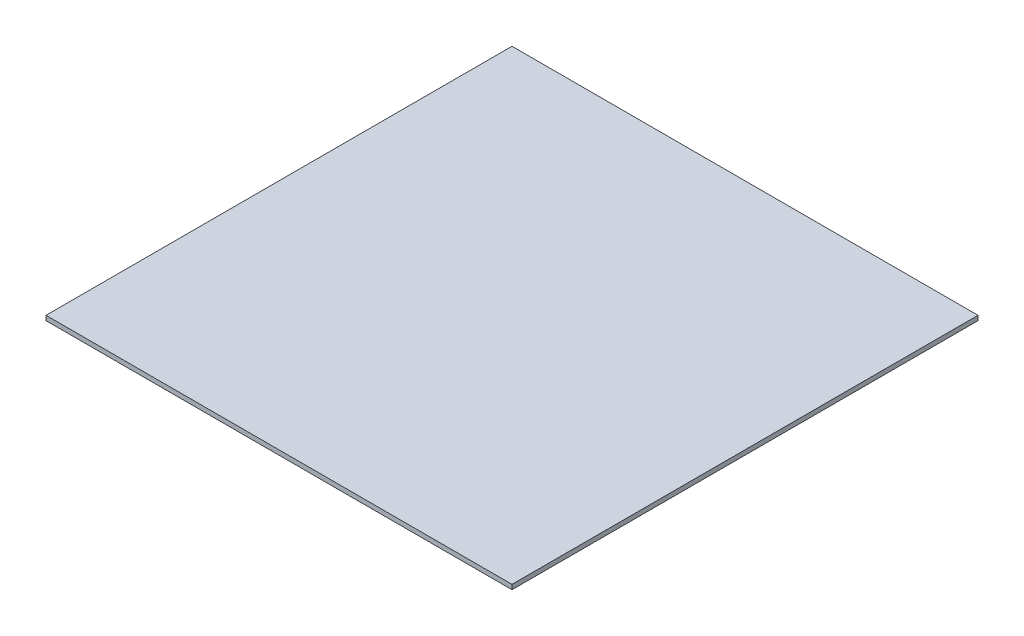
ISO-10303-21;
HEADER;
FILE_DESCRIPTION(('STEP AP214'),'2;1');
FILE_NAME('part.step','',(''),(''),'','','');
FILE_SCHEMA(('AUTOMOTIVE_DESIGN { 1 0 10303 214 1 1 1 1 }'));
ENDSEC;
DATA;
#1=APPLICATION_CONTEXT('core data for automotive mechanical design processes');
#2=APPLICATION_PROTOCOL_DEFINITION('international standard','automotive_design',2000,#1);
#3=PRODUCT_CONTEXT('',#1,'mechanical');
#4=PRODUCT('Part','Part','',(#3));
#5=PRODUCT_RELATED_PRODUCT_CATEGORY('part','',(#4));
#6=PRODUCT_DEFINITION_FORMATION('','',#4);
#7=PRODUCT_DEFINITION_CONTEXT('part definition',#1,'design');
#8=PRODUCT_DEFINITION('design','',#6,#7);
#9=PRODUCT_DEFINITION_SHAPE('','',#8);
#10=(LENGTH_UNIT() NAMED_UNIT(*) SI_UNIT(.MILLI.,.METRE.));
#11=(NAMED_UNIT(*) PLANE_ANGLE_UNIT() SI_UNIT($,.RADIAN.));
#12=(NAMED_UNIT(*) SI_UNIT($,.STERADIAN.) SOLID_ANGLE_UNIT());
#13=UNCERTAINTY_MEASURE_WITH_UNIT(LENGTH_MEASURE(1.E-05),#10,'distance_accuracy_value','');
#14=(GEOMETRIC_REPRESENTATION_CONTEXT(3) GLOBAL_UNCERTAINTY_ASSIGNED_CONTEXT((#13)) GLOBAL_UNIT_ASSIGNED_CONTEXT((#10,
#11,#12)) REPRESENTATION_CONTEXT('',''));
#15=CARTESIAN_POINT('',(0.,0.,0.));
#16=DIRECTION('',(0.,0.,1.));
#17=DIRECTION('',(1.,0.,0.));
#18=AXIS2_PLACEMENT_3D('',#15,#16,#17);
#19=CARTESIAN_POINT('',(0.,5.08,0.));
#20=DIRECTION('',(-1.,0.,0.));
#21=DIRECTION('',(0.,0.,1.));
#22=AXIS2_PLACEMENT_3D('',#19,#20,#21);
#23=PLANE('',#22);
#24=DIRECTION('',(0.,0.,-1.));
#25=VECTOR('',#24,1.);
#26=CARTESIAN_POINT('',(0.,0.,0.));
#27=LINE('',#26,#25);
#28=CARTESIAN_POINT('',(0.,0.,508.));
#29=VERTEX_POINT('',#28);
#30=CARTESIAN_POINT('',(0.,0.,0.));
#31=VERTEX_POINT('',#30);
#32=EDGE_CURVE('E96',#29,#31,#27,.T.);
#33=ORIENTED_EDGE('',*,*,#32,.T.);
#34=DIRECTION('',(0.,-1.,0.));
#35=VECTOR('',#34,1.);
#36=CARTESIAN_POINT('',(0.,5.08,0.));
#37=LINE('',#36,#35);
#38=CARTESIAN_POINT('',(0.,5.08,0.));
#39=VERTEX_POINT('',#38);
#40=EDGE_CURVE('E11',#39,#31,#37,.T.);
#41=ORIENTED_EDGE('',*,*,#40,.F.);
#42=DIRECTION('',(0.,0.,-1.));
#43=VECTOR('',#42,1.);
#44=CARTESIAN_POINT('',(0.,5.08,0.));
#45=LINE('',#44,#43);
#46=CARTESIAN_POINT('',(0.,5.08,508.));
#47=VERTEX_POINT('',#46);
#48=EDGE_CURVE('E84',#47,#39,#45,.T.);
#49=ORIENTED_EDGE('',*,*,#48,.F.);
#50=DIRECTION('',(0.,-1.,0.));
#51=VECTOR('',#50,1.);
#52=CARTESIAN_POINT('',(0.,5.08,508.));
#53=LINE('',#52,#51);
#54=EDGE_CURVE('E92',#47,#29,#53,.T.);
#55=ORIENTED_EDGE('',*,*,#54,.T.);
#56=EDGE_LOOP('',(#33,#41,#49,#55));
#57=FACE_BOUND('',#56,.T.);
#58=ADVANCED_FACE('F33',(#57),#23,.F.);
#59=CARTESIAN_POINT('',(0.,5.08,0.));
#60=DIRECTION('',(0.,0.,1.));
#61=DIRECTION('',(1.,0.,0.));
#62=AXIS2_PLACEMENT_3D('',#59,#60,#61);
#63=PLANE('',#62);
#64=DIRECTION('',(-1.,0.,0.));
#65=VECTOR('',#64,1.);
#66=CARTESIAN_POINT('',(0.,0.,0.));
#67=LINE('',#66,#65);
#68=CARTESIAN_POINT('',(-508.,0.,1.25425546361983E-13));
#69=VERTEX_POINT('',#68);
#70=EDGE_CURVE('E88',#31,#69,#67,.T.);
#71=ORIENTED_EDGE('',*,*,#70,.T.);
#72=DIRECTION('',(0.,-1.,0.));
#73=VECTOR('',#72,1.);
#74=CARTESIAN_POINT('',(-508.,5.08,1.25425546361983E-13));
#75=LINE('',#74,#73);
#76=CARTESIAN_POINT('',(-508.,5.08,1.25425546361983E-13));
#77=VERTEX_POINT('',#76);
#78=EDGE_CURVE('E41',#77,#69,#75,.T.);
#79=ORIENTED_EDGE('',*,*,#78,.F.);
#80=DIRECTION('',(-1.,0.,0.));
#81=VECTOR('',#80,1.);
#82=CARTESIAN_POINT('',(0.,5.08,0.));
#83=LINE('',#82,#81);
#84=EDGE_CURVE('E79',#39,#77,#83,.T.);
#85=ORIENTED_EDGE('',*,*,#84,.F.);
#86=ORIENTED_EDGE('',*,*,#40,.T.);
#87=EDGE_LOOP('',(#71,#79,#85,#86));
#88=FACE_BOUND('',#87,.T.);
#89=ADVANCED_FACE('F87',(#88),#63,.F.);
#90=CARTESIAN_POINT('',(-508.,5.08,1.25425546361983E-13));
#91=DIRECTION('',(1.,0.,0.));
#92=DIRECTION('',(0.,0.,-1.));
#93=AXIS2_PLACEMENT_3D('',#90,#91,#92);
#94=PLANE('',#93);
#95=DIRECTION('',(0.,0.,1.));
#96=VECTOR('',#95,1.);
#97=CARTESIAN_POINT('',(-508.,0.,1.25425546361983E-13));
#98=LINE('',#97,#96);
#99=CARTESIAN_POINT('',(-508.,0.,508.));
#100=VERTEX_POINT('',#99);
#101=EDGE_CURVE('E66',#69,#100,#98,.T.);
#102=ORIENTED_EDGE('',*,*,#101,.T.);
#103=DIRECTION('',(0.,-1.,0.));
#104=VECTOR('',#103,1.);
#105=CARTESIAN_POINT('',(-508.,5.08,508.));
#106=LINE('',#105,#104);
#107=CARTESIAN_POINT('',(-508.,5.08,508.));
#108=VERTEX_POINT('',#107);
#109=EDGE_CURVE('E89',#108,#100,#106,.T.);
#110=ORIENTED_EDGE('',*,*,#109,.F.);
#111=DIRECTION('',(0.,0.,1.));
#112=VECTOR('',#111,1.);
#113=CARTESIAN_POINT('',(-508.,5.08,1.25425546361983E-13));
#114=LINE('',#113,#112);
#115=EDGE_CURVE('E82',#77,#108,#114,.T.);
#116=ORIENTED_EDGE('',*,*,#115,.F.);
#117=ORIENTED_EDGE('',*,*,#78,.T.);
#118=EDGE_LOOP('',(#102,#110,#116,#117));
#119=FACE_BOUND('',#118,.T.);
#120=ADVANCED_FACE('F90',(#119),#94,.F.);
#121=CARTESIAN_POINT('',(0.,5.08,508.));
#122=DIRECTION('',(0.,0.,-1.));
#123=DIRECTION('',(-1.,0.,0.));
#124=AXIS2_PLACEMENT_3D('',#121,#122,#123);
#125=PLANE('',#124);
#126=DIRECTION('',(1.,0.,0.));
#127=VECTOR('',#126,1.);
#128=CARTESIAN_POINT('',(0.,0.,508.));
#129=LINE('',#128,#127);
#130=EDGE_CURVE('E72',#100,#29,#129,.T.);
#131=ORIENTED_EDGE('',*,*,#130,.T.);
#132=ORIENTED_EDGE('',*,*,#54,.F.);
#133=DIRECTION('',(1.,0.,0.));
#134=VECTOR('',#133,1.);
#135=CARTESIAN_POINT('',(0.,5.08,508.));
#136=LINE('',#135,#134);
#137=EDGE_CURVE('E49',#108,#47,#136,.T.);
#138=ORIENTED_EDGE('',*,*,#137,.F.);
#139=ORIENTED_EDGE('',*,*,#109,.T.);
#140=EDGE_LOOP('',(#131,#132,#138,#139));
#141=FACE_BOUND('',#140,.T.);
#142=ADVANCED_FACE('F103',(#141),#125,.F.);
#143=CARTESIAN_POINT('',(0.,5.08,0.));
#144=DIRECTION('',(0.,-1.,0.));
#145=DIRECTION('',(0.,0.,-1.));
#146=AXIS2_PLACEMENT_3D('',#143,#144,#145);
#147=PLANE('',#146);
#148=ORIENTED_EDGE('',*,*,#48,.T.);
#149=ORIENTED_EDGE('',*,*,#84,.T.);
#150=ORIENTED_EDGE('',*,*,#115,.T.);
#151=ORIENTED_EDGE('',*,*,#137,.T.);
#152=EDGE_LOOP('',(#148,#149,#150,#151));
#153=FACE_BOUND('',#152,.T.);
#154=ADVANCED_FACE('F80',(#153),#147,.F.);
#155=CARTESIAN_POINT('',(0.,0.,0.));
#156=DIRECTION('',(0.,-1.,0.));
#157=DIRECTION('',(0.,0.,-1.));
#158=AXIS2_PLACEMENT_3D('',#155,#156,#157);
#159=PLANE('',#158);
#160=ORIENTED_EDGE('',*,*,#32,.F.);
#161=ORIENTED_EDGE('',*,*,#130,.F.);
#162=ORIENTED_EDGE('',*,*,#101,.F.);
#163=ORIENTED_EDGE('',*,*,#70,.F.);
#164=EDGE_LOOP('',(#160,#161,#162,#163));
#165=FACE_BOUND('',#164,.T.);
#166=ADVANCED_FACE('F106',(#165),#159,.T.);
#167=CLOSED_SHELL('',(#58,#89,#120,#142,#154,#166));
#168=MANIFOLD_SOLID_BREP('B2',#167);
#169=ADVANCED_BREP_SHAPE_REPRESENTATION('',(#18,#168),#14);
#170=SHAPE_DEFINITION_REPRESENTATION(#9,#169);
ENDSEC;
END-ISO-10303-21;
